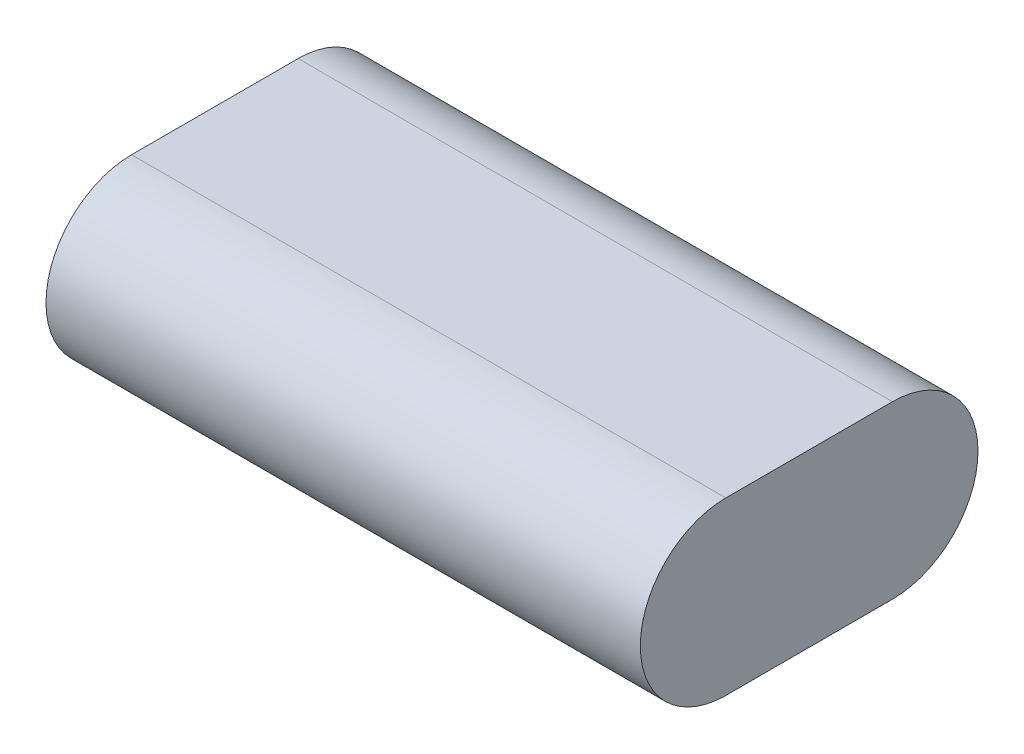
ISO-10303-21;
HEADER;
FILE_DESCRIPTION(('STEP AP214'),'2;1');
FILE_NAME('part.step','',(''),(''),'','','');
FILE_SCHEMA(('AUTOMOTIVE_DESIGN { 1 0 10303 214 1 1 1 1 }'));
ENDSEC;
DATA;
#1=APPLICATION_CONTEXT('core data for automotive mechanical design processes');
#2=APPLICATION_PROTOCOL_DEFINITION('international standard','automotive_design',2000,#1);
#3=PRODUCT_CONTEXT('',#1,'mechanical');
#4=PRODUCT('Part','Part','',(#3));
#5=PRODUCT_RELATED_PRODUCT_CATEGORY('part','',(#4));
#6=PRODUCT_DEFINITION_FORMATION('','',#4);
#7=PRODUCT_DEFINITION_CONTEXT('part definition',#1,'design');
#8=PRODUCT_DEFINITION('design','',#6,#7);
#9=PRODUCT_DEFINITION_SHAPE('','',#8);
#10=(LENGTH_UNIT() NAMED_UNIT(*) SI_UNIT(.MILLI.,.METRE.));
#11=(NAMED_UNIT(*) PLANE_ANGLE_UNIT() SI_UNIT($,.RADIAN.));
#12=(NAMED_UNIT(*) SI_UNIT($,.STERADIAN.) SOLID_ANGLE_UNIT());
#13=UNCERTAINTY_MEASURE_WITH_UNIT(LENGTH_MEASURE(1.E-05),#10,'distance_accuracy_value','');
#14=(GEOMETRIC_REPRESENTATION_CONTEXT(3) GLOBAL_UNCERTAINTY_ASSIGNED_CONTEXT((#13)) GLOBAL_UNIT_ASSIGNED_CONTEXT((#10,
#11,#12)) REPRESENTATION_CONTEXT('',''));
#15=CARTESIAN_POINT('',(0.,0.,0.));
#16=DIRECTION('',(0.,0.,1.));
#17=DIRECTION('',(1.,0.,0.));
#18=AXIS2_PLACEMENT_3D('',#15,#16,#17);
#19=CARTESIAN_POINT('',(33.,9.5,-9.25000000000001));
#20=DIRECTION('',(-1.,0.,0.));
#21=DIRECTION('',(0.,0.,1.));
#22=AXIS2_PLACEMENT_3D('',#19,#20,#21);
#23=CYLINDRICAL_SURFACE('',#22,9.5);
#24=DIRECTION('',(-1.,0.,0.));
#25=VECTOR('',#24,1.);
#26=CARTESIAN_POINT('',(0.,19.,-9.25000000000001));
#27=LINE('',#26,#25);
#28=CARTESIAN_POINT('',(33.,19.,-9.25000000000001));
#29=VERTEX_POINT('',#28);
#30=CARTESIAN_POINT('',(-33.,19.,-9.25));
#31=VERTEX_POINT('',#30);
#32=EDGE_CURVE('E87',#29,#31,#27,.T.);
#33=ORIENTED_EDGE('',*,*,#32,.F.);
#34=CARTESIAN_POINT('',(33.,9.5,-9.25000000000001));
#35=DIRECTION('',(-1.,0.,0.));
#36=DIRECTION('',(0.,0.,1.));
#37=AXIS2_PLACEMENT_3D('',#34,#35,#36);
#38=CIRCLE('',#37,9.5);
#39=CARTESIAN_POINT('',(33.,0.,-9.25000000000001));
#40=VERTEX_POINT('',#39);
#41=EDGE_CURVE('E50',#40,#29,#38,.F.);
#42=ORIENTED_EDGE('',*,*,#41,.F.);
#43=DIRECTION('',(1.,0.,0.));
#44=VECTOR('',#43,1.);
#45=CARTESIAN_POINT('',(33.,0.,-9.25000000000001));
#46=LINE('',#45,#44);
#47=CARTESIAN_POINT('',(-33.,0.,-9.25));
#48=VERTEX_POINT('',#47);
#49=EDGE_CURVE('E118',#48,#40,#46,.T.);
#50=ORIENTED_EDGE('',*,*,#49,.F.);
#51=CARTESIAN_POINT('',(-33.,9.5,-9.25));
#52=DIRECTION('',(1.,0.,0.));
#53=DIRECTION('',(0.,0.,-1.));
#54=AXIS2_PLACEMENT_3D('',#51,#52,#53);
#55=CIRCLE('',#54,9.5);
#56=EDGE_CURVE('E11',#31,#48,#55,.F.);
#57=ORIENTED_EDGE('',*,*,#56,.F.);
#58=EDGE_LOOP('',(#33,#42,#50,#57));
#59=FACE_BOUND('',#58,.T.);
#60=ADVANCED_FACE('F41',(#59),#23,.T.);
#61=CARTESIAN_POINT('',(-33.,9.5,9.24999999999999));
#62=DIRECTION('',(1.,0.,0.));
#63=DIRECTION('',(0.,0.,-1.));
#64=AXIS2_PLACEMENT_3D('',#61,#62,#63);
#65=CYLINDRICAL_SURFACE('',#64,9.5);
#66=DIRECTION('',(1.,0.,0.));
#67=VECTOR('',#66,1.);
#68=CARTESIAN_POINT('',(0.,19.,9.24999999999999));
#69=LINE('',#68,#67);
#70=CARTESIAN_POINT('',(-33.,19.,9.24999999999999));
#71=VERTEX_POINT('',#70);
#72=CARTESIAN_POINT('',(33.,19.,9.24999999999999));
#73=VERTEX_POINT('',#72);
#74=EDGE_CURVE('E85',#71,#73,#69,.T.);
#75=ORIENTED_EDGE('',*,*,#74,.F.);
#76=CARTESIAN_POINT('',(-33.,9.5,9.24999999999999));
#77=DIRECTION('',(1.,0.,0.));
#78=DIRECTION('',(0.,0.,-1.));
#79=AXIS2_PLACEMENT_3D('',#76,#77,#78);
#80=CIRCLE('',#79,9.5);
#81=CARTESIAN_POINT('',(-33.,0.,9.24999999999999));
#82=VERTEX_POINT('',#81);
#83=EDGE_CURVE('E93',#82,#71,#80,.F.);
#84=ORIENTED_EDGE('',*,*,#83,.F.);
#85=DIRECTION('',(-1.,0.,0.));
#86=VECTOR('',#85,1.);
#87=CARTESIAN_POINT('',(-33.,0.,9.24999999999999));
#88=LINE('',#87,#86);
#89=CARTESIAN_POINT('',(33.,0.,9.24999999999999));
#90=VERTEX_POINT('',#89);
#91=EDGE_CURVE('E102',#90,#82,#88,.T.);
#92=ORIENTED_EDGE('',*,*,#91,.F.);
#93=CARTESIAN_POINT('',(33.,9.5,9.24999999999999));
#94=DIRECTION('',(-1.,0.,0.));
#95=DIRECTION('',(0.,0.,1.));
#96=AXIS2_PLACEMENT_3D('',#93,#94,#95);
#97=CIRCLE('',#96,9.5);
#98=EDGE_CURVE('E101',#73,#90,#97,.F.);
#99=ORIENTED_EDGE('',*,*,#98,.F.);
#100=EDGE_LOOP('',(#75,#84,#92,#99));
#101=FACE_BOUND('',#100,.T.);
#102=ADVANCED_FACE('F104',(#101),#65,.T.);
#103=CARTESIAN_POINT('',(-33.,19.,-18.75));
#104=DIRECTION('',(1.,0.,0.));
#105=DIRECTION('',(0.,0.,-1.));
#106=AXIS2_PLACEMENT_3D('',#103,#104,#105);
#107=PLANE('',#106);
#108=DIRECTION('',(0.,0.,1.));
#109=VECTOR('',#108,1.);
#110=CARTESIAN_POINT('',(-33.,19.,-18.75));
#111=LINE('',#110,#109);
#112=EDGE_CURVE('E80',#31,#71,#111,.T.);
#113=ORIENTED_EDGE('',*,*,#112,.F.);
#114=ORIENTED_EDGE('',*,*,#56,.T.);
#115=DIRECTION('',(0.,0.,1.));
#116=VECTOR('',#115,1.);
#117=CARTESIAN_POINT('',(-33.,0.,-18.75));
#118=LINE('',#117,#116);
#119=EDGE_CURVE('E96',#48,#82,#118,.T.);
#120=ORIENTED_EDGE('',*,*,#119,.T.);
#121=ORIENTED_EDGE('',*,*,#83,.T.);
#122=EDGE_LOOP('',(#113,#114,#120,#121));
#123=FACE_BOUND('',#122,.T.);
#124=ADVANCED_FACE('F94',(#123),#107,.F.);
#125=CARTESIAN_POINT('',(33.,19.,-18.75));
#126=DIRECTION('',(-1.,0.,0.));
#127=DIRECTION('',(0.,0.,1.));
#128=AXIS2_PLACEMENT_3D('',#125,#126,#127);
#129=PLANE('',#128);
#130=DIRECTION('',(0.,0.,-1.));
#131=VECTOR('',#130,1.);
#132=CARTESIAN_POINT('',(33.,0.,-18.75));
#133=LINE('',#132,#131);
#134=EDGE_CURVE('E90',#90,#40,#133,.T.);
#135=ORIENTED_EDGE('',*,*,#134,.T.);
#136=ORIENTED_EDGE('',*,*,#41,.T.);
#137=DIRECTION('',(0.,0.,-1.));
#138=VECTOR('',#137,1.);
#139=CARTESIAN_POINT('',(33.,19.,-18.75));
#140=LINE('',#139,#138);
#141=EDGE_CURVE('E89',#73,#29,#140,.T.);
#142=ORIENTED_EDGE('',*,*,#141,.F.);
#143=ORIENTED_EDGE('',*,*,#98,.T.);
#144=EDGE_LOOP('',(#135,#136,#142,#143));
#145=FACE_BOUND('',#144,.T.);
#146=ADVANCED_FACE('F123',(#145),#129,.F.);
#147=CARTESIAN_POINT('',(0.,19.,0.));
#148=DIRECTION('',(0.,-1.,0.));
#149=DIRECTION('',(0.,0.,-1.));
#150=AXIS2_PLACEMENT_3D('',#147,#148,#149);
#151=PLANE('',#150);
#152=ORIENTED_EDGE('',*,*,#141,.T.);
#153=ORIENTED_EDGE('',*,*,#32,.T.);
#154=ORIENTED_EDGE('',*,*,#112,.T.);
#155=ORIENTED_EDGE('',*,*,#74,.T.);
#156=EDGE_LOOP('',(#152,#153,#154,#155));
#157=FACE_BOUND('',#156,.T.);
#158=ADVANCED_FACE('F83',(#157),#151,.F.);
#159=CARTESIAN_POINT('',(0.,0.,0.));
#160=DIRECTION('',(0.,-1.,0.));
#161=DIRECTION('',(0.,0.,-1.));
#162=AXIS2_PLACEMENT_3D('',#159,#160,#161);
#163=PLANE('',#162);
#164=ORIENTED_EDGE('',*,*,#119,.F.);
#165=ORIENTED_EDGE('',*,*,#49,.T.);
#166=ORIENTED_EDGE('',*,*,#134,.F.);
#167=ORIENTED_EDGE('',*,*,#91,.T.);
#168=EDGE_LOOP('',(#164,#165,#166,#167));
#169=FACE_BOUND('',#168,.T.);
#170=ADVANCED_FACE('F126',(#169),#163,.T.);
#171=CLOSED_SHELL('',(#60,#102,#124,#146,#158,#170));
#172=MANIFOLD_SOLID_BREP('B2',#171);
#173=ADVANCED_BREP_SHAPE_REPRESENTATION('',(#18,#172),#14);
#174=SHAPE_DEFINITION_REPRESENTATION(#9,#173);
ENDSEC;
END-ISO-10303-21;
